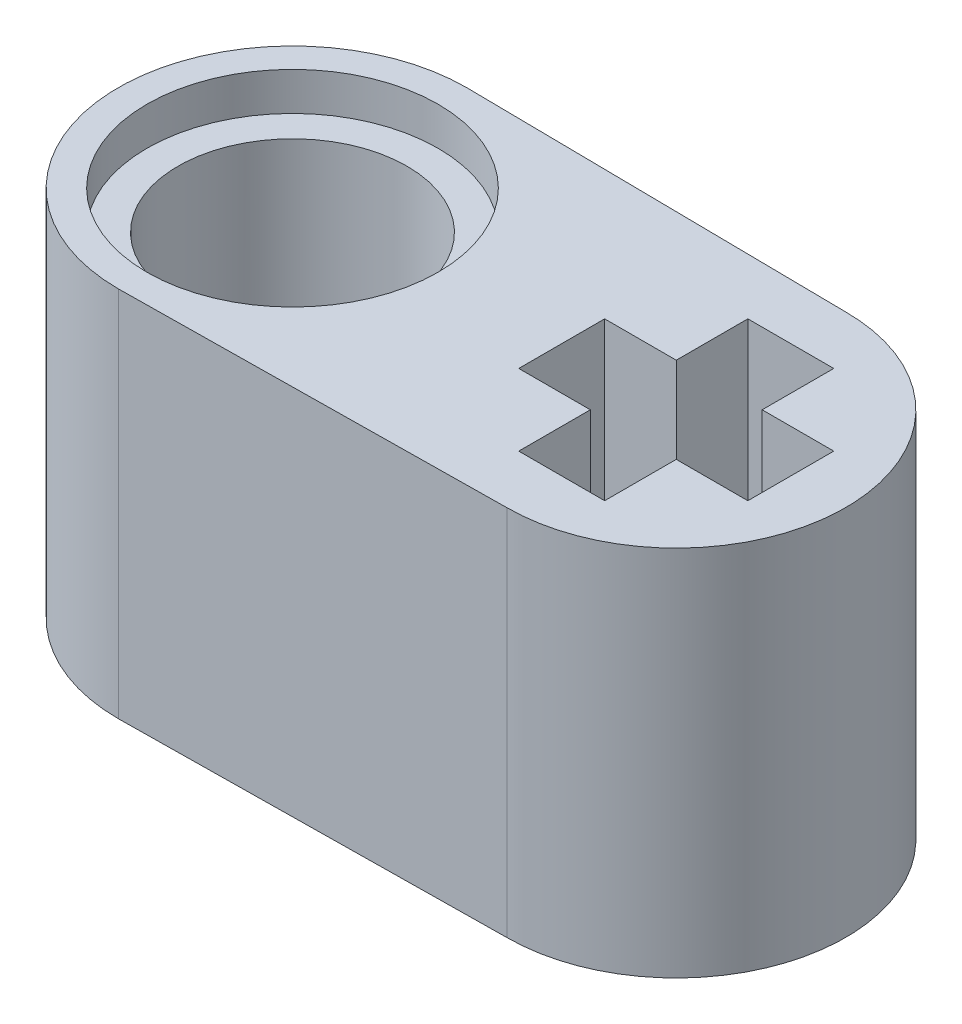
ISO-10303-21;
HEADER;
FILE_DESCRIPTION(('STEP AP214'),'2;1');
FILE_NAME('part.step','',(''),(''),'','','');
FILE_SCHEMA(('AUTOMOTIVE_DESIGN { 1 0 10303 214 1 1 1 1 }'));
ENDSEC;
DATA;
#1=APPLICATION_CONTEXT('core data for automotive mechanical design processes');
#2=APPLICATION_PROTOCOL_DEFINITION('international standard','automotive_design',2000,#1);
#3=PRODUCT_CONTEXT('',#1,'mechanical');
#4=PRODUCT('Part','Part','',(#3));
#5=PRODUCT_RELATED_PRODUCT_CATEGORY('part','',(#4));
#6=PRODUCT_DEFINITION_FORMATION('','',#4);
#7=PRODUCT_DEFINITION_CONTEXT('part definition',#1,'design');
#8=PRODUCT_DEFINITION('design','',#6,#7);
#9=PRODUCT_DEFINITION_SHAPE('','',#8);
#10=(LENGTH_UNIT() NAMED_UNIT(*) SI_UNIT(.MILLI.,.METRE.));
#11=(NAMED_UNIT(*) PLANE_ANGLE_UNIT() SI_UNIT($,.RADIAN.));
#12=(NAMED_UNIT(*) SI_UNIT($,.STERADIAN.) SOLID_ANGLE_UNIT());
#13=UNCERTAINTY_MEASURE_WITH_UNIT(LENGTH_MEASURE(1.E-05),#10,'distance_accuracy_value','');
#14=(GEOMETRIC_REPRESENTATION_CONTEXT(3) GLOBAL_UNCERTAINTY_ASSIGNED_CONTEXT((#13)) GLOBAL_UNIT_ASSIGNED_CONTEXT((#10,
#11,#12)) REPRESENTATION_CONTEXT('',''));
#15=CARTESIAN_POINT('',(0.,0.,0.));
#16=DIRECTION('',(0.,0.,1.));
#17=DIRECTION('',(1.,0.,0.));
#18=AXIS2_PLACEMENT_3D('',#15,#16,#17);
#19=CARTESIAN_POINT('',(-4.07,7.8,0.));
#20=DIRECTION('',(0.,-1.,0.));
#21=DIRECTION('',(0.,0.,-1.));
#22=AXIS2_PLACEMENT_3D('',#19,#20,#21);
#23=CYLINDRICAL_SURFACE('',#22,2.4);
#24=CARTESIAN_POINT('',(-4.07,7.,0.));
#25=DIRECTION('',(0.,1.,0.));
#26=DIRECTION('',(0.,0.,1.));
#27=AXIS2_PLACEMENT_3D('',#24,#25,#26);
#28=CIRCLE('',#27,2.4);
#29=CARTESIAN_POINT('',(-4.07,7.,2.4));
#30=VERTEX_POINT('',#29);
#31=EDGE_CURVE('E194',#30,#30,#28,.T.);
#32=ORIENTED_EDGE('',*,*,#31,.T.);
#33=EDGE_LOOP('',(#32));
#34=FACE_BOUND('',#33,.T.);
#35=CARTESIAN_POINT('',(-4.07,0.8,0.));
#36=DIRECTION('',(0.,-1.,0.));
#37=DIRECTION('',(0.,0.,-1.));
#38=AXIS2_PLACEMENT_3D('',#35,#36,#37);
#39=CIRCLE('',#38,2.4);
#40=CARTESIAN_POINT('',(-4.07,0.8,-2.4));
#41=VERTEX_POINT('',#40);
#42=EDGE_CURVE('E37',#41,#41,#39,.T.);
#43=ORIENTED_EDGE('',*,*,#42,.T.);
#44=EDGE_LOOP('',(#43));
#45=FACE_BOUND('',#44,.T.);
#46=ADVANCED_FACE('F33',(#34,#45),#23,.F.);
#47=CARTESIAN_POINT('',(-4.07,7.8,0.));
#48=DIRECTION('',(0.,1.,0.));
#49=DIRECTION('',(0.,0.,1.));
#50=AXIS2_PLACEMENT_3D('',#47,#48,#49);
#51=PLANE('',#50);
#52=CARTESIAN_POINT('',(-4.07,7.8,0.));
#53=DIRECTION('',(0.,1.,0.));
#54=DIRECTION('',(0.,0.,1.));
#55=AXIS2_PLACEMENT_3D('',#52,#53,#54);
#56=CIRCLE('',#55,3.05);
#57=CARTESIAN_POINT('',(-4.07,7.8,3.05));
#58=VERTEX_POINT('',#57);
#59=EDGE_CURVE('E273',#58,#58,#56,.T.);
#60=ORIENTED_EDGE('',*,*,#59,.F.);
#61=EDGE_LOOP('',(#60));
#62=FACE_BOUND('',#61,.T.);
#63=CARTESIAN_POINT('',(-4.07,7.8,0.));
#64=DIRECTION('',(0.,1.,0.));
#65=DIRECTION('',(0.,0.,1.));
#66=AXIS2_PLACEMENT_3D('',#63,#64,#65);
#67=CIRCLE('',#66,3.65);
#68=CARTESIAN_POINT('',(-4.07,7.8,-3.65));
#69=VERTEX_POINT('',#68);
#70=CARTESIAN_POINT('',(-4.07,7.8,3.65));
#71=VERTEX_POINT('',#70);
#72=EDGE_CURVE('E244',#69,#71,#67,.T.);
#73=ORIENTED_EDGE('',*,*,#72,.T.);
#74=DIRECTION('',(0.999922659402722,0.,-0.0124368489975462));
#75=VECTOR('',#74,1.);
#76=CARTESIAN_POINT('',(-4.07,7.8,3.65));
#77=LINE('',#76,#75);
#78=CARTESIAN_POINT('',(3.97,7.8,3.55));
#79=VERTEX_POINT('',#78);
#80=EDGE_CURVE('E247',#71,#79,#77,.T.);
#81=ORIENTED_EDGE('',*,*,#80,.T.);
#82=CARTESIAN_POINT('',(3.97,7.8,0.));
#83=DIRECTION('',(0.,1.,0.));
#84=DIRECTION('',(0.,0.,1.));
#85=AXIS2_PLACEMENT_3D('',#82,#83,#84);
#86=CIRCLE('',#85,3.55);
#87=CARTESIAN_POINT('',(3.97,7.8,-3.55));
#88=VERTEX_POINT('',#87);
#89=EDGE_CURVE('E250',#79,#88,#86,.T.);
#90=ORIENTED_EDGE('',*,*,#89,.T.);
#91=DIRECTION('',(-0.999922659402722,0.,-0.012436848997546));
#92=VECTOR('',#91,1.);
#93=CARTESIAN_POINT('',(-4.07,7.8,-3.65));
#94=LINE('',#93,#92);
#95=EDGE_CURVE('E252',#88,#69,#94,.T.);
#96=ORIENTED_EDGE('',*,*,#95,.T.);
#97=EDGE_LOOP('',(#73,#81,#90,#96));
#98=FACE_BOUND('',#97,.T.);
#99=DIRECTION('',(1.,0.,0.));
#100=VECTOR('',#99,1.);
#101=CARTESIAN_POINT('',(6.37,7.8,0.9));
#102=LINE('',#101,#100);
#103=CARTESIAN_POINT('',(4.87,7.8,0.9));
#104=VERTEX_POINT('',#103);
#105=CARTESIAN_POINT('',(6.37,7.8,0.9));
#106=VERTEX_POINT('',#105);
#107=EDGE_CURVE('E156',#104,#106,#102,.T.);
#108=ORIENTED_EDGE('',*,*,#107,.F.);
#109=DIRECTION('',(0.,0.,-1.));
#110=VECTOR('',#109,1.);
#111=CARTESIAN_POINT('',(4.87,7.8,0.9));
#112=LINE('',#111,#110);
#113=CARTESIAN_POINT('',(4.87,7.8,2.4));
#114=VERTEX_POINT('',#113);
#115=EDGE_CURVE('E148',#114,#104,#112,.T.);
#116=ORIENTED_EDGE('',*,*,#115,.F.);
#117=DIRECTION('',(1.,0.,0.));
#118=VECTOR('',#117,1.);
#119=CARTESIAN_POINT('',(3.07,7.8,2.4));
#120=LINE('',#119,#118);
#121=CARTESIAN_POINT('',(3.07,7.8,2.4));
#122=VERTEX_POINT('',#121);
#123=EDGE_CURVE('E191',#122,#114,#120,.T.);
#124=ORIENTED_EDGE('',*,*,#123,.F.);
#125=DIRECTION('',(0.,0.,1.));
#126=VECTOR('',#125,1.);
#127=CARTESIAN_POINT('',(3.07,7.8,0.9));
#128=LINE('',#127,#126);
#129=CARTESIAN_POINT('',(3.07,7.8,0.9));
#130=VERTEX_POINT('',#129);
#131=EDGE_CURVE('E189',#130,#122,#128,.T.);
#132=ORIENTED_EDGE('',*,*,#131,.F.);
#133=DIRECTION('',(1.,0.,0.));
#134=VECTOR('',#133,1.);
#135=CARTESIAN_POINT('',(3.07,7.8,0.9));
#136=LINE('',#135,#134);
#137=CARTESIAN_POINT('',(1.57,7.8,0.9));
#138=VERTEX_POINT('',#137);
#139=EDGE_CURVE('E187',#138,#130,#136,.T.);
#140=ORIENTED_EDGE('',*,*,#139,.F.);
#141=DIRECTION('',(0.,0.,1.));
#142=VECTOR('',#141,1.);
#143=CARTESIAN_POINT('',(1.57,7.8,0.9));
#144=LINE('',#143,#142);
#145=CARTESIAN_POINT('',(1.57,7.8,-0.899999999999999));
#146=VERTEX_POINT('',#145);
#147=EDGE_CURVE('E185',#146,#138,#144,.T.);
#148=ORIENTED_EDGE('',*,*,#147,.F.);
#149=DIRECTION('',(-1.,0.,0.));
#150=VECTOR('',#149,1.);
#151=CARTESIAN_POINT('',(3.07,7.8,-0.9));
#152=LINE('',#151,#150);
#153=CARTESIAN_POINT('',(3.07,7.8,-0.9));
#154=VERTEX_POINT('',#153);
#155=EDGE_CURVE('E183',#154,#146,#152,.T.);
#156=ORIENTED_EDGE('',*,*,#155,.F.);
#157=DIRECTION('',(0.,0.,1.));
#158=VECTOR('',#157,1.);
#159=CARTESIAN_POINT('',(3.07,7.8,-2.4));
#160=LINE('',#159,#158);
#161=CARTESIAN_POINT('',(3.07,7.8,-2.4));
#162=VERTEX_POINT('',#161);
#163=EDGE_CURVE('E181',#162,#154,#160,.T.);
#164=ORIENTED_EDGE('',*,*,#163,.F.);
#165=DIRECTION('',(-1.,0.,0.));
#166=VECTOR('',#165,1.);
#167=CARTESIAN_POINT('',(3.07,7.8,-2.4));
#168=LINE('',#167,#166);
#169=CARTESIAN_POINT('',(4.87,7.8,-2.4));
#170=VERTEX_POINT('',#169);
#171=EDGE_CURVE('E179',#170,#162,#168,.T.);
#172=ORIENTED_EDGE('',*,*,#171,.F.);
#173=DIRECTION('',(0.,0.,-1.));
#174=VECTOR('',#173,1.);
#175=CARTESIAN_POINT('',(4.87,7.8,-2.4));
#176=LINE('',#175,#174);
#177=CARTESIAN_POINT('',(4.87,7.8,-0.9));
#178=VERTEX_POINT('',#177);
#179=EDGE_CURVE('E177',#178,#170,#176,.T.);
#180=ORIENTED_EDGE('',*,*,#179,.F.);
#181=DIRECTION('',(-1.,0.,0.));
#182=VECTOR('',#181,1.);
#183=CARTESIAN_POINT('',(6.37,7.8,-0.9));
#184=LINE('',#183,#182);
#185=CARTESIAN_POINT('',(6.37,7.8,-0.9));
#186=VERTEX_POINT('',#185);
#187=EDGE_CURVE('E172',#186,#178,#184,.T.);
#188=ORIENTED_EDGE('',*,*,#187,.F.);
#189=DIRECTION('',(0.,0.,-1.));
#190=VECTOR('',#189,1.);
#191=CARTESIAN_POINT('',(6.37,7.8,0.9));
#192=LINE('',#191,#190);
#193=EDGE_CURVE('E170',#106,#186,#192,.T.);
#194=ORIENTED_EDGE('',*,*,#193,.F.);
#195=EDGE_LOOP('',(#108,#116,#124,#132,#140,#148,#156,#164,#172,#180,#188,#194));
#196=FACE_BOUND('',#195,.T.);
#197=ADVANCED_FACE('F168',(#62,#98,#196),#51,.T.);
#198=CARTESIAN_POINT('',(-4.07,0.,0.));
#199=DIRECTION('',(0.,1.,0.));
#200=DIRECTION('',(0.,0.,1.));
#201=AXIS2_PLACEMENT_3D('',#198,#199,#200);
#202=PLANE('',#201);
#203=CARTESIAN_POINT('',(-4.07,0.,0.));
#204=DIRECTION('',(0.,-1.,0.));
#205=DIRECTION('',(0.,0.,-1.));
#206=AXIS2_PLACEMENT_3D('',#203,#204,#205);
#207=CIRCLE('',#206,3.05);
#208=CARTESIAN_POINT('',(-4.07,0.,-3.05));
#209=VERTEX_POINT('',#208);
#210=EDGE_CURVE('E279',#209,#209,#207,.T.);
#211=ORIENTED_EDGE('',*,*,#210,.F.);
#212=EDGE_LOOP('',(#211));
#213=FACE_BOUND('',#212,.T.);
#214=CARTESIAN_POINT('',(-4.07,0.,0.));
#215=DIRECTION('',(0.,1.,0.));
#216=DIRECTION('',(0.,0.,1.));
#217=AXIS2_PLACEMENT_3D('',#214,#215,#216);
#218=CIRCLE('',#217,3.65);
#219=CARTESIAN_POINT('',(-4.07,0.,-3.65));
#220=VERTEX_POINT('',#219);
#221=CARTESIAN_POINT('',(-4.07,0.,3.65));
#222=VERTEX_POINT('',#221);
#223=EDGE_CURVE('E164',#220,#222,#218,.T.);
#224=ORIENTED_EDGE('',*,*,#223,.F.);
#225=DIRECTION('',(-0.999922659402722,0.,-0.012436848997546));
#226=VECTOR('',#225,1.);
#227=CARTESIAN_POINT('',(-4.07,0.,-3.65));
#228=LINE('',#227,#226);
#229=CARTESIAN_POINT('',(3.97,0.,-3.55));
#230=VERTEX_POINT('',#229);
#231=EDGE_CURVE('E248',#230,#220,#228,.T.);
#232=ORIENTED_EDGE('',*,*,#231,.F.);
#233=CARTESIAN_POINT('',(3.97,0.,0.));
#234=DIRECTION('',(0.,1.,0.));
#235=DIRECTION('',(0.,0.,1.));
#236=AXIS2_PLACEMENT_3D('',#233,#234,#235);
#237=CIRCLE('',#236,3.55);
#238=CARTESIAN_POINT('',(3.97,0.,3.55));
#239=VERTEX_POINT('',#238);
#240=EDGE_CURVE('E259',#239,#230,#237,.T.);
#241=ORIENTED_EDGE('',*,*,#240,.F.);
#242=DIRECTION('',(0.999922659402722,0.,-0.0124368489975462));
#243=VECTOR('',#242,1.);
#244=CARTESIAN_POINT('',(-4.07,0.,3.65));
#245=LINE('',#244,#243);
#246=EDGE_CURVE('E257',#222,#239,#245,.T.);
#247=ORIENTED_EDGE('',*,*,#246,.F.);
#248=EDGE_LOOP('',(#224,#232,#241,#247));
#249=FACE_BOUND('',#248,.T.);
#250=DIRECTION('',(0.,0.,-1.));
#251=VECTOR('',#250,1.);
#252=CARTESIAN_POINT('',(4.87,0.,0.9));
#253=LINE('',#252,#251);
#254=CARTESIAN_POINT('',(4.87,0.,2.4));
#255=VERTEX_POINT('',#254);
#256=CARTESIAN_POINT('',(4.87,0.,0.9));
#257=VERTEX_POINT('',#256);
#258=EDGE_CURVE('E58',#255,#257,#253,.T.);
#259=ORIENTED_EDGE('',*,*,#258,.T.);
#260=DIRECTION('',(1.,0.,0.));
#261=VECTOR('',#260,1.);
#262=CARTESIAN_POINT('',(6.37,0.,0.9));
#263=LINE('',#262,#261);
#264=CARTESIAN_POINT('',(6.37,0.,0.9));
#265=VERTEX_POINT('',#264);
#266=EDGE_CURVE('E163',#257,#265,#263,.T.);
#267=ORIENTED_EDGE('',*,*,#266,.T.);
#268=DIRECTION('',(0.,0.,-1.));
#269=VECTOR('',#268,1.);
#270=CARTESIAN_POINT('',(6.37,0.,0.9));
#271=LINE('',#270,#269);
#272=CARTESIAN_POINT('',(6.37,0.,-0.9));
#273=VERTEX_POINT('',#272);
#274=EDGE_CURVE('E196',#265,#273,#271,.T.);
#275=ORIENTED_EDGE('',*,*,#274,.T.);
#276=DIRECTION('',(-1.,0.,0.));
#277=VECTOR('',#276,1.);
#278=CARTESIAN_POINT('',(6.37,0.,-0.9));
#279=LINE('',#278,#277);
#280=CARTESIAN_POINT('',(4.87,0.,-0.9));
#281=VERTEX_POINT('',#280);
#282=EDGE_CURVE('E199',#273,#281,#279,.T.);
#283=ORIENTED_EDGE('',*,*,#282,.T.);
#284=DIRECTION('',(0.,0.,-1.));
#285=VECTOR('',#284,1.);
#286=CARTESIAN_POINT('',(4.87,0.,-2.4));
#287=LINE('',#286,#285);
#288=CARTESIAN_POINT('',(4.87,0.,-2.4));
#289=VERTEX_POINT('',#288);
#290=EDGE_CURVE('E202',#281,#289,#287,.T.);
#291=ORIENTED_EDGE('',*,*,#290,.T.);
#292=DIRECTION('',(-1.,0.,0.));
#293=VECTOR('',#292,1.);
#294=CARTESIAN_POINT('',(3.07,0.,-2.4));
#295=LINE('',#294,#293);
#296=CARTESIAN_POINT('',(3.07,0.,-2.4));
#297=VERTEX_POINT('',#296);
#298=EDGE_CURVE('E205',#289,#297,#295,.T.);
#299=ORIENTED_EDGE('',*,*,#298,.T.);
#300=DIRECTION('',(0.,0.,1.));
#301=VECTOR('',#300,1.);
#302=CARTESIAN_POINT('',(3.07,0.,-2.4));
#303=LINE('',#302,#301);
#304=CARTESIAN_POINT('',(3.07,0.,-0.9));
#305=VERTEX_POINT('',#304);
#306=EDGE_CURVE('E208',#297,#305,#303,.T.);
#307=ORIENTED_EDGE('',*,*,#306,.T.);
#308=DIRECTION('',(-1.,0.,0.));
#309=VECTOR('',#308,1.);
#310=CARTESIAN_POINT('',(3.07,0.,-0.9));
#311=LINE('',#310,#309);
#312=CARTESIAN_POINT('',(1.57,0.,-0.899999999999999));
#313=VERTEX_POINT('',#312);
#314=EDGE_CURVE('E211',#305,#313,#311,.T.);
#315=ORIENTED_EDGE('',*,*,#314,.T.);
#316=DIRECTION('',(0.,0.,1.));
#317=VECTOR('',#316,1.);
#318=CARTESIAN_POINT('',(1.57,0.,0.9));
#319=LINE('',#318,#317);
#320=CARTESIAN_POINT('',(1.57,0.,0.9));
#321=VERTEX_POINT('',#320);
#322=EDGE_CURVE('E214',#313,#321,#319,.T.);
#323=ORIENTED_EDGE('',*,*,#322,.T.);
#324=DIRECTION('',(1.,0.,0.));
#325=VECTOR('',#324,1.);
#326=CARTESIAN_POINT('',(3.07,0.,0.9));
#327=LINE('',#326,#325);
#328=CARTESIAN_POINT('',(3.07,0.,0.9));
#329=VERTEX_POINT('',#328);
#330=EDGE_CURVE('E217',#321,#329,#327,.T.);
#331=ORIENTED_EDGE('',*,*,#330,.T.);
#332=DIRECTION('',(0.,0.,1.));
#333=VECTOR('',#332,1.);
#334=CARTESIAN_POINT('',(3.07,0.,0.9));
#335=LINE('',#334,#333);
#336=CARTESIAN_POINT('',(3.07,0.,2.4));
#337=VERTEX_POINT('',#336);
#338=EDGE_CURVE('E220',#329,#337,#335,.T.);
#339=ORIENTED_EDGE('',*,*,#338,.T.);
#340=DIRECTION('',(1.,0.,0.));
#341=VECTOR('',#340,1.);
#342=CARTESIAN_POINT('',(3.07,0.,2.4));
#343=LINE('',#342,#341);
#344=EDGE_CURVE('E157',#337,#255,#343,.T.);
#345=ORIENTED_EDGE('',*,*,#344,.T.);
#346=EDGE_LOOP('',(#259,#267,#275,#283,#291,#299,#307,#315,#323,#331,#339,#345));
#347=FACE_BOUND('',#346,.T.);
#348=ADVANCED_FACE('F305',(#213,#249,#347),#202,.F.);
#349=CARTESIAN_POINT('',(-4.07,7.8,0.));
#350=DIRECTION('',(0.,-1.,0.));
#351=DIRECTION('',(0.,0.,-1.));
#352=AXIS2_PLACEMENT_3D('',#349,#350,#351);
#353=CYLINDRICAL_SURFACE('',#352,3.65);
#354=ORIENTED_EDGE('',*,*,#223,.T.);
#355=DIRECTION('',(0.,-1.,0.));
#356=VECTOR('',#355,1.);
#357=CARTESIAN_POINT('',(-4.07,7.8,3.65));
#358=LINE('',#357,#356);
#359=EDGE_CURVE('E11',#71,#222,#358,.T.);
#360=ORIENTED_EDGE('',*,*,#359,.F.);
#361=ORIENTED_EDGE('',*,*,#72,.F.);
#362=DIRECTION('',(0.,-1.,0.));
#363=VECTOR('',#362,1.);
#364=CARTESIAN_POINT('',(-4.07,7.8,-3.65));
#365=LINE('',#364,#363);
#366=EDGE_CURVE('E254',#69,#220,#365,.T.);
#367=ORIENTED_EDGE('',*,*,#366,.T.);
#368=EDGE_LOOP('',(#354,#360,#361,#367));
#369=FACE_BOUND('',#368,.T.);
#370=ADVANCED_FACE('F35',(#369),#353,.T.);
#371=CARTESIAN_POINT('',(-4.07,7.8,3.65));
#372=DIRECTION('',(-0.0124368489975462,0.,-0.999922659402722));
#373=DIRECTION('',(-0.999922659402722,0.,0.0124368489975462));
#374=AXIS2_PLACEMENT_3D('',#371,#372,#373);
#375=PLANE('',#374);
#376=ORIENTED_EDGE('',*,*,#246,.T.);
#377=DIRECTION('',(0.,-1.,0.));
#378=VECTOR('',#377,1.);
#379=CARTESIAN_POINT('',(3.97,7.8,3.55));
#380=LINE('',#379,#378);
#381=EDGE_CURVE('E42',#79,#239,#380,.T.);
#382=ORIENTED_EDGE('',*,*,#381,.F.);
#383=ORIENTED_EDGE('',*,*,#80,.F.);
#384=ORIENTED_EDGE('',*,*,#359,.T.);
#385=EDGE_LOOP('',(#376,#382,#383,#384));
#386=FACE_BOUND('',#385,.T.);
#387=ADVANCED_FACE('F320',(#386),#375,.F.);
#388=CARTESIAN_POINT('',(3.97,7.8,0.));
#389=DIRECTION('',(0.,-1.,0.));
#390=DIRECTION('',(0.,0.,-1.));
#391=AXIS2_PLACEMENT_3D('',#388,#389,#390);
#392=CYLINDRICAL_SURFACE('',#391,3.55);
#393=ORIENTED_EDGE('',*,*,#240,.T.);
#394=DIRECTION('',(0.,-1.,0.));
#395=VECTOR('',#394,1.);
#396=CARTESIAN_POINT('',(3.97,7.8,-3.55));
#397=LINE('',#396,#395);
#398=EDGE_CURVE('E264',#88,#230,#397,.T.);
#399=ORIENTED_EDGE('',*,*,#398,.F.);
#400=ORIENTED_EDGE('',*,*,#89,.F.);
#401=ORIENTED_EDGE('',*,*,#381,.T.);
#402=EDGE_LOOP('',(#393,#399,#400,#401));
#403=FACE_BOUND('',#402,.T.);
#404=ADVANCED_FACE('F317',(#403),#392,.T.);
#405=CARTESIAN_POINT('',(-4.07,7.8,-3.65));
#406=DIRECTION('',(-0.012436848997546,0.,0.999922659402722));
#407=DIRECTION('',(0.999922659402722,0.,0.012436848997546));
#408=AXIS2_PLACEMENT_3D('',#405,#406,#407);
#409=PLANE('',#408);
#410=ORIENTED_EDGE('',*,*,#231,.T.);
#411=ORIENTED_EDGE('',*,*,#366,.F.);
#412=ORIENTED_EDGE('',*,*,#95,.F.);
#413=ORIENTED_EDGE('',*,*,#398,.T.);
#414=EDGE_LOOP('',(#410,#411,#412,#413));
#415=FACE_BOUND('',#414,.T.);
#416=ADVANCED_FACE('F314',(#415),#409,.F.);
#417=CARTESIAN_POINT('',(4.87,7.8,0.9));
#418=DIRECTION('',(-1.,0.,0.));
#419=DIRECTION('',(0.,0.,1.));
#420=AXIS2_PLACEMENT_3D('',#417,#418,#419);
#421=PLANE('',#420);
#422=ORIENTED_EDGE('',*,*,#258,.F.);
#423=DIRECTION('',(0.,-1.,0.));
#424=VECTOR('',#423,1.);
#425=CARTESIAN_POINT('',(4.87,7.8,2.4));
#426=LINE('',#425,#424);
#427=EDGE_CURVE('E152',#114,#255,#426,.T.);
#428=ORIENTED_EDGE('',*,*,#427,.F.);
#429=ORIENTED_EDGE('',*,*,#115,.T.);
#430=DIRECTION('',(0.,-1.,0.));
#431=VECTOR('',#430,1.);
#432=CARTESIAN_POINT('',(4.87,7.8,0.9));
#433=LINE('',#432,#431);
#434=EDGE_CURVE('E151',#104,#257,#433,.T.);
#435=ORIENTED_EDGE('',*,*,#434,.T.);
#436=EDGE_LOOP('',(#422,#428,#429,#435));
#437=FACE_BOUND('',#436,.T.);
#438=ADVANCED_FACE('F150',(#437),#421,.T.);
#439=CARTESIAN_POINT('',(6.37,7.8,0.9));
#440=DIRECTION('',(0.,0.,-1.));
#441=DIRECTION('',(-1.,0.,0.));
#442=AXIS2_PLACEMENT_3D('',#439,#440,#441);
#443=PLANE('',#442);
#444=ORIENTED_EDGE('',*,*,#266,.F.);
#445=ORIENTED_EDGE('',*,*,#434,.F.);
#446=ORIENTED_EDGE('',*,*,#107,.T.);
#447=DIRECTION('',(0.,-1.,0.));
#448=VECTOR('',#447,1.);
#449=CARTESIAN_POINT('',(6.37,7.8,0.9));
#450=LINE('',#449,#448);
#451=EDGE_CURVE('E165',#106,#265,#450,.T.);
#452=ORIENTED_EDGE('',*,*,#451,.T.);
#453=EDGE_LOOP('',(#444,#445,#446,#452));
#454=FACE_BOUND('',#453,.T.);
#455=ADVANCED_FACE('F160',(#454),#443,.T.);
#456=CARTESIAN_POINT('',(6.37,7.8,0.9));
#457=DIRECTION('',(-1.,0.,0.));
#458=DIRECTION('',(0.,0.,1.));
#459=AXIS2_PLACEMENT_3D('',#456,#457,#458);
#460=PLANE('',#459);
#461=ORIENTED_EDGE('',*,*,#274,.F.);
#462=ORIENTED_EDGE('',*,*,#451,.F.);
#463=ORIENTED_EDGE('',*,*,#193,.T.);
#464=DIRECTION('',(0.,-1.,0.));
#465=VECTOR('',#464,1.);
#466=CARTESIAN_POINT('',(6.37,7.8,-0.9));
#467=LINE('',#466,#465);
#468=EDGE_CURVE('E241',#186,#273,#467,.T.);
#469=ORIENTED_EDGE('',*,*,#468,.T.);
#470=EDGE_LOOP('',(#461,#462,#463,#469));
#471=FACE_BOUND('',#470,.T.);
#472=ADVANCED_FACE('F383',(#471),#460,.T.);
#473=CARTESIAN_POINT('',(6.37,7.8,-0.9));
#474=DIRECTION('',(0.,0.,1.));
#475=DIRECTION('',(1.,0.,0.));
#476=AXIS2_PLACEMENT_3D('',#473,#474,#475);
#477=PLANE('',#476);
#478=ORIENTED_EDGE('',*,*,#282,.F.);
#479=ORIENTED_EDGE('',*,*,#468,.F.);
#480=ORIENTED_EDGE('',*,*,#187,.T.);
#481=DIRECTION('',(0.,-1.,0.));
#482=VECTOR('',#481,1.);
#483=CARTESIAN_POINT('',(4.87,7.8,-0.9));
#484=LINE('',#483,#482);
#485=EDGE_CURVE('E239',#178,#281,#484,.T.);
#486=ORIENTED_EDGE('',*,*,#485,.T.);
#487=EDGE_LOOP('',(#478,#479,#480,#486));
#488=FACE_BOUND('',#487,.T.);
#489=ADVANCED_FACE('F379',(#488),#477,.T.);
#490=CARTESIAN_POINT('',(4.87,7.8,-2.4));
#491=DIRECTION('',(-1.,0.,0.));
#492=DIRECTION('',(0.,0.,1.));
#493=AXIS2_PLACEMENT_3D('',#490,#491,#492);
#494=PLANE('',#493);
#495=ORIENTED_EDGE('',*,*,#290,.F.);
#496=ORIENTED_EDGE('',*,*,#485,.F.);
#497=ORIENTED_EDGE('',*,*,#179,.T.);
#498=DIRECTION('',(0.,-1.,0.));
#499=VECTOR('',#498,1.);
#500=CARTESIAN_POINT('',(4.87,7.8,-2.4));
#501=LINE('',#500,#499);
#502=EDGE_CURVE('E237',#170,#289,#501,.T.);
#503=ORIENTED_EDGE('',*,*,#502,.T.);
#504=EDGE_LOOP('',(#495,#496,#497,#503));
#505=FACE_BOUND('',#504,.T.);
#506=ADVANCED_FACE('F376',(#505),#494,.T.);
#507=CARTESIAN_POINT('',(3.07,7.8,-2.4));
#508=DIRECTION('',(0.,0.,1.));
#509=DIRECTION('',(1.,0.,0.));
#510=AXIS2_PLACEMENT_3D('',#507,#508,#509);
#511=PLANE('',#510);
#512=ORIENTED_EDGE('',*,*,#298,.F.);
#513=ORIENTED_EDGE('',*,*,#502,.F.);
#514=ORIENTED_EDGE('',*,*,#171,.T.);
#515=DIRECTION('',(0.,-1.,0.));
#516=VECTOR('',#515,1.);
#517=CARTESIAN_POINT('',(3.07,7.8,-2.4));
#518=LINE('',#517,#516);
#519=EDGE_CURVE('E235',#162,#297,#518,.T.);
#520=ORIENTED_EDGE('',*,*,#519,.T.);
#521=EDGE_LOOP('',(#512,#513,#514,#520));
#522=FACE_BOUND('',#521,.T.);
#523=ADVANCED_FACE('F370',(#522),#511,.T.);
#524=CARTESIAN_POINT('',(3.07,7.8,-2.4));
#525=DIRECTION('',(1.,0.,0.));
#526=DIRECTION('',(0.,0.,-1.));
#527=AXIS2_PLACEMENT_3D('',#524,#525,#526);
#528=PLANE('',#527);
#529=ORIENTED_EDGE('',*,*,#306,.F.);
#530=ORIENTED_EDGE('',*,*,#519,.F.);
#531=ORIENTED_EDGE('',*,*,#163,.T.);
#532=DIRECTION('',(0.,-1.,0.));
#533=VECTOR('',#532,1.);
#534=CARTESIAN_POINT('',(3.07,7.8,-0.9));
#535=LINE('',#534,#533);
#536=EDGE_CURVE('E233',#154,#305,#535,.T.);
#537=ORIENTED_EDGE('',*,*,#536,.T.);
#538=EDGE_LOOP('',(#529,#530,#531,#537));
#539=FACE_BOUND('',#538,.T.);
#540=ADVANCED_FACE('F366',(#539),#528,.T.);
#541=CARTESIAN_POINT('',(3.07,7.8,-0.9));
#542=DIRECTION('',(0.,0.,1.));
#543=DIRECTION('',(1.,0.,0.));
#544=AXIS2_PLACEMENT_3D('',#541,#542,#543);
#545=PLANE('',#544);
#546=ORIENTED_EDGE('',*,*,#314,.F.);
#547=ORIENTED_EDGE('',*,*,#536,.F.);
#548=ORIENTED_EDGE('',*,*,#155,.T.);
#549=DIRECTION('',(0.,-1.,0.));
#550=VECTOR('',#549,1.);
#551=CARTESIAN_POINT('',(1.57,7.8,-0.899999999999999));
#552=LINE('',#551,#550);
#553=EDGE_CURVE('E231',#146,#313,#552,.T.);
#554=ORIENTED_EDGE('',*,*,#553,.T.);
#555=EDGE_LOOP('',(#546,#547,#548,#554));
#556=FACE_BOUND('',#555,.T.);
#557=ADVANCED_FACE('F363',(#556),#545,.T.);
#558=CARTESIAN_POINT('',(1.57,7.8,0.9));
#559=DIRECTION('',(1.,0.,0.));
#560=DIRECTION('',(0.,0.,-1.));
#561=AXIS2_PLACEMENT_3D('',#558,#559,#560);
#562=PLANE('',#561);
#563=ORIENTED_EDGE('',*,*,#322,.F.);
#564=ORIENTED_EDGE('',*,*,#553,.F.);
#565=ORIENTED_EDGE('',*,*,#147,.T.);
#566=DIRECTION('',(0.,-1.,0.));
#567=VECTOR('',#566,1.);
#568=CARTESIAN_POINT('',(1.57,7.8,0.9));
#569=LINE('',#568,#567);
#570=EDGE_CURVE('E229',#138,#321,#569,.T.);
#571=ORIENTED_EDGE('',*,*,#570,.T.);
#572=EDGE_LOOP('',(#563,#564,#565,#571));
#573=FACE_BOUND('',#572,.T.);
#574=ADVANCED_FACE('F355',(#573),#562,.T.);
#575=CARTESIAN_POINT('',(3.07,7.8,0.9));
#576=DIRECTION('',(0.,0.,-1.));
#577=DIRECTION('',(-1.,0.,0.));
#578=AXIS2_PLACEMENT_3D('',#575,#576,#577);
#579=PLANE('',#578);
#580=ORIENTED_EDGE('',*,*,#330,.F.);
#581=ORIENTED_EDGE('',*,*,#570,.F.);
#582=ORIENTED_EDGE('',*,*,#139,.T.);
#583=DIRECTION('',(0.,-1.,0.));
#584=VECTOR('',#583,1.);
#585=CARTESIAN_POINT('',(3.07,7.8,0.9));
#586=LINE('',#585,#584);
#587=EDGE_CURVE('E227',#130,#329,#586,.T.);
#588=ORIENTED_EDGE('',*,*,#587,.T.);
#589=EDGE_LOOP('',(#580,#581,#582,#588));
#590=FACE_BOUND('',#589,.T.);
#591=ADVANCED_FACE('F351',(#590),#579,.T.);
#592=CARTESIAN_POINT('',(3.07,7.8,0.9));
#593=DIRECTION('',(1.,0.,0.));
#594=DIRECTION('',(0.,0.,-1.));
#595=AXIS2_PLACEMENT_3D('',#592,#593,#594);
#596=PLANE('',#595);
#597=ORIENTED_EDGE('',*,*,#338,.F.);
#598=ORIENTED_EDGE('',*,*,#587,.F.);
#599=ORIENTED_EDGE('',*,*,#131,.T.);
#600=DIRECTION('',(0.,-1.,0.));
#601=VECTOR('',#600,1.);
#602=CARTESIAN_POINT('',(3.07,7.8,2.4));
#603=LINE('',#602,#601);
#604=EDGE_CURVE('E50',#122,#337,#603,.T.);
#605=ORIENTED_EDGE('',*,*,#604,.T.);
#606=EDGE_LOOP('',(#597,#598,#599,#605));
#607=FACE_BOUND('',#606,.T.);
#608=ADVANCED_FACE('F348',(#607),#596,.T.);
#609=CARTESIAN_POINT('',(3.07,7.8,2.4));
#610=DIRECTION('',(0.,0.,-1.));
#611=DIRECTION('',(-1.,0.,0.));
#612=AXIS2_PLACEMENT_3D('',#609,#610,#611);
#613=PLANE('',#612);
#614=ORIENTED_EDGE('',*,*,#344,.F.);
#615=ORIENTED_EDGE('',*,*,#604,.F.);
#616=ORIENTED_EDGE('',*,*,#123,.T.);
#617=ORIENTED_EDGE('',*,*,#427,.T.);
#618=EDGE_LOOP('',(#614,#615,#616,#617));
#619=FACE_BOUND('',#618,.T.);
#620=ADVANCED_FACE('F342',(#619),#613,.T.);
#621=CARTESIAN_POINT('',(-4.07,7.,0.));
#622=DIRECTION('',(0.,1.,0.));
#623=DIRECTION('',(0.,0.,1.));
#624=AXIS2_PLACEMENT_3D('',#621,#622,#623);
#625=CYLINDRICAL_SURFACE('',#624,3.05);
#626=CARTESIAN_POINT('',(-4.07,7.,0.));
#627=DIRECTION('',(0.,1.,0.));
#628=DIRECTION('',(0.,0.,1.));
#629=AXIS2_PLACEMENT_3D('',#626,#627,#628);
#630=CIRCLE('',#629,3.05);
#631=CARTESIAN_POINT('',(-4.07,7.,3.05));
#632=VERTEX_POINT('',#631);
#633=EDGE_CURVE('E269',#632,#632,#630,.T.);
#634=ORIENTED_EDGE('',*,*,#633,.F.);
#635=EDGE_LOOP('',(#634));
#636=FACE_BOUND('',#635,.T.);
#637=ORIENTED_EDGE('',*,*,#59,.T.);
#638=EDGE_LOOP('',(#637));
#639=FACE_BOUND('',#638,.T.);
#640=ADVANCED_FACE('F408',(#636,#639),#625,.F.);
#641=CARTESIAN_POINT('',(-4.07,7.,0.));
#642=DIRECTION('',(0.,1.,0.));
#643=DIRECTION('',(0.,0.,1.));
#644=AXIS2_PLACEMENT_3D('',#641,#642,#643);
#645=PLANE('',#644);
#646=ORIENTED_EDGE('',*,*,#31,.F.);
#647=EDGE_LOOP('',(#646));
#648=FACE_BOUND('',#647,.T.);
#649=ORIENTED_EDGE('',*,*,#633,.T.);
#650=EDGE_LOOP('',(#649));
#651=FACE_BOUND('',#650,.T.);
#652=ADVANCED_FACE('F297',(#648,#651),#645,.T.);
#653=CARTESIAN_POINT('',(-4.07,0.8,0.));
#654=DIRECTION('',(0.,-1.,0.));
#655=DIRECTION('',(0.,0.,-1.));
#656=AXIS2_PLACEMENT_3D('',#653,#654,#655);
#657=CYLINDRICAL_SURFACE('',#656,3.05);
#658=CARTESIAN_POINT('',(-4.07,0.8,0.));
#659=DIRECTION('',(0.,-1.,0.));
#660=DIRECTION('',(0.,0.,-1.));
#661=AXIS2_PLACEMENT_3D('',#658,#659,#660);
#662=CIRCLE('',#661,3.05);
#663=CARTESIAN_POINT('',(-4.07,0.8,-3.05));
#664=VERTEX_POINT('',#663);
#665=EDGE_CURVE('E282',#664,#664,#662,.T.);
#666=ORIENTED_EDGE('',*,*,#665,.F.);
#667=EDGE_LOOP('',(#666));
#668=FACE_BOUND('',#667,.T.);
#669=ORIENTED_EDGE('',*,*,#210,.T.);
#670=EDGE_LOOP('',(#669));
#671=FACE_BOUND('',#670,.T.);
#672=ADVANCED_FACE('F292',(#668,#671),#657,.F.);
#673=CARTESIAN_POINT('',(-4.07,0.8,0.));
#674=DIRECTION('',(0.,-1.,0.));
#675=DIRECTION('',(0.,0.,-1.));
#676=AXIS2_PLACEMENT_3D('',#673,#674,#675);
#677=PLANE('',#676);
#678=ORIENTED_EDGE('',*,*,#42,.F.);
#679=EDGE_LOOP('',(#678));
#680=FACE_BOUND('',#679,.T.);
#681=ORIENTED_EDGE('',*,*,#665,.T.);
#682=EDGE_LOOP('',(#681));
#683=FACE_BOUND('',#682,.T.);
#684=ADVANCED_FACE('F290',(#680,#683),#677,.T.);
#685=CLOSED_SHELL('',(#46,#197,#348,#370,#387,#404,#416,#438,#455,#472,#489,#506,#523,#540,#557,
#574,#591,#608,#620,#640,#652,#672,#684));
#686=MANIFOLD_SOLID_BREP('B2',#685);
#687=ADVANCED_BREP_SHAPE_REPRESENTATION('',(#18,#686),#14);
#688=SHAPE_DEFINITION_REPRESENTATION(#9,#687);
ENDSEC;
END-ISO-10303-21;
